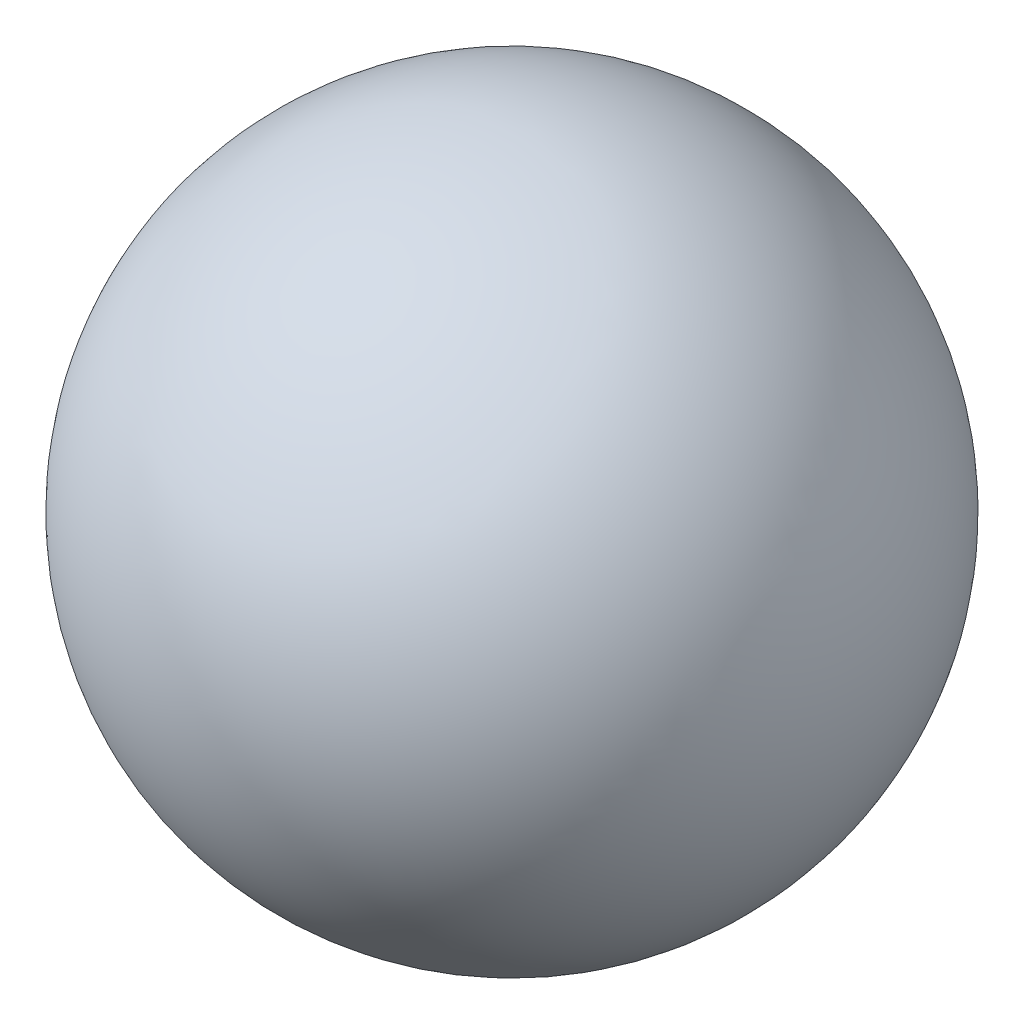
ISO-10303-21;
HEADER;
FILE_DESCRIPTION(('STEP AP214'),'2;1');
FILE_NAME('part.step','',(''),(''),'','','');
FILE_SCHEMA(('AUTOMOTIVE_DESIGN { 1 0 10303 214 1 1 1 1 }'));
ENDSEC;
DATA;
#1=APPLICATION_CONTEXT('core data for automotive mechanical design processes');
#2=APPLICATION_PROTOCOL_DEFINITION('international standard','automotive_design',2000,#1);
#3=PRODUCT_CONTEXT('',#1,'mechanical');
#4=PRODUCT('Part','Part','',(#3));
#5=PRODUCT_RELATED_PRODUCT_CATEGORY('part','',(#4));
#6=PRODUCT_DEFINITION_FORMATION('','',#4);
#7=PRODUCT_DEFINITION_CONTEXT('part definition',#1,'design');
#8=PRODUCT_DEFINITION('design','',#6,#7);
#9=PRODUCT_DEFINITION_SHAPE('','',#8);
#10=(LENGTH_UNIT() NAMED_UNIT(*) SI_UNIT(.MILLI.,.METRE.));
#11=(NAMED_UNIT(*) PLANE_ANGLE_UNIT() SI_UNIT($,.RADIAN.));
#12=(NAMED_UNIT(*) SI_UNIT($,.STERADIAN.) SOLID_ANGLE_UNIT());
#13=UNCERTAINTY_MEASURE_WITH_UNIT(LENGTH_MEASURE(1.E-05),#10,'distance_accuracy_value','');
#14=(GEOMETRIC_REPRESENTATION_CONTEXT(3) GLOBAL_UNCERTAINTY_ASSIGNED_CONTEXT((#13)) GLOBAL_UNIT_ASSIGNED_CONTEXT((#10,
#11,#12)) REPRESENTATION_CONTEXT('',''));
#15=CARTESIAN_POINT('',(0.,0.,0.));
#16=DIRECTION('',(0.,0.,1.));
#17=DIRECTION('',(1.,0.,0.));
#18=AXIS2_PLACEMENT_3D('',#15,#16,#17);
#19=CARTESIAN_POINT('',(0.,0.,0.));
#20=DIRECTION('',(-1.,0.,0.));
#21=DIRECTION('',(0.,1.,0.));
#22=AXIS2_PLACEMENT_3D('',#19,#20,#21);
#23=SPHERICAL_SURFACE('',#22,1000.);
#24=CARTESIAN_POINT('',(-1000.,0.,0.));
#25=VERTEX_POINT('',#24);
#26=VERTEX_LOOP('',#25);
#27=FACE_BOUND('',#26,.T.);
#28=ADVANCED_FACE('F344',(#27),#23,.T.);
#29=CLOSED_SHELL('',(#28));
#30=MANIFOLD_SOLID_BREP('B2',#29);
#31=ADVANCED_BREP_SHAPE_REPRESENTATION('',(#18,#30),#14);
#32=SHAPE_DEFINITION_REPRESENTATION(#9,#31);
ENDSEC;
END-ISO-10303-21;
